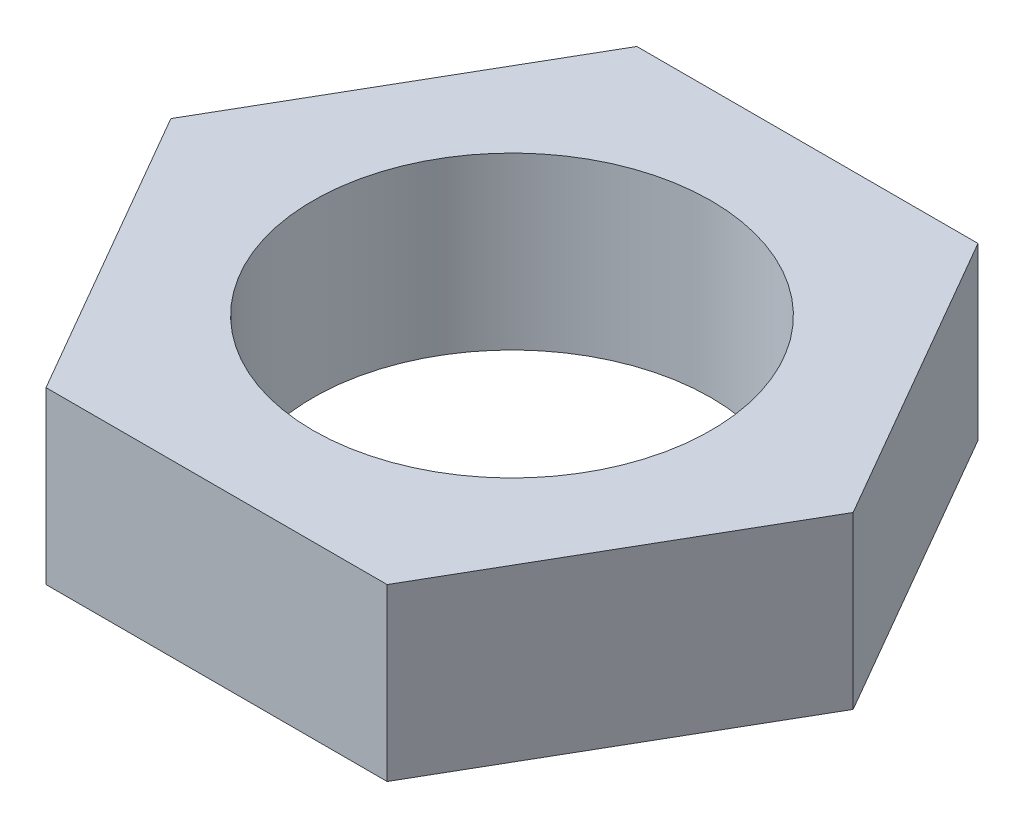
ISO-10303-21;
HEADER;
FILE_DESCRIPTION(('STEP AP214'),'2;1');
FILE_NAME('part.step','',(''),(''),'','','');
FILE_SCHEMA(('AUTOMOTIVE_DESIGN { 1 0 10303 214 1 1 1 1 }'));
ENDSEC;
DATA;
#1=APPLICATION_CONTEXT('core data for automotive mechanical design processes');
#2=APPLICATION_PROTOCOL_DEFINITION('international standard','automotive_design',2000,#1);
#3=PRODUCT_CONTEXT('',#1,'mechanical');
#4=PRODUCT('Part','Part','',(#3));
#5=PRODUCT_RELATED_PRODUCT_CATEGORY('part','',(#4));
#6=PRODUCT_DEFINITION_FORMATION('','',#4);
#7=PRODUCT_DEFINITION_CONTEXT('part definition',#1,'design');
#8=PRODUCT_DEFINITION('design','',#6,#7);
#9=PRODUCT_DEFINITION_SHAPE('','',#8);
#10=(LENGTH_UNIT() NAMED_UNIT(*) SI_UNIT(.MILLI.,.METRE.));
#11=(NAMED_UNIT(*) PLANE_ANGLE_UNIT() SI_UNIT($,.RADIAN.));
#12=(NAMED_UNIT(*) SI_UNIT($,.STERADIAN.) SOLID_ANGLE_UNIT());
#13=UNCERTAINTY_MEASURE_WITH_UNIT(LENGTH_MEASURE(1.E-05),#10,'distance_accuracy_value','');
#14=(GEOMETRIC_REPRESENTATION_CONTEXT(3) GLOBAL_UNCERTAINTY_ASSIGNED_CONTEXT((#13)) GLOBAL_UNIT_ASSIGNED_CONTEXT((#10,
#11,#12)) REPRESENTATION_CONTEXT('',''));
#15=CARTESIAN_POINT('',(0.,0.,0.));
#16=DIRECTION('',(0.,0.,1.));
#17=DIRECTION('',(1.,0.,0.));
#18=AXIS2_PLACEMENT_3D('',#15,#16,#17);
#19=CARTESIAN_POINT('',(3.00000000000005,3.,5.19615242270659));
#20=DIRECTION('',(-0.866025403784441,0.,-0.499999999999995));
#21=DIRECTION('',(-0.499999999999995,0.,0.866025403784442));
#22=AXIS2_PLACEMENT_3D('',#19,#20,#21);
#23=PLANE('',#22);
#24=DIRECTION('',(0.499999999999995,0.,-0.866025403784442));
#25=VECTOR('',#24,1.);
#26=CARTESIAN_POINT('',(3.00000000000005,0.,5.19615242270659));
#27=LINE('',#26,#25);
#28=CARTESIAN_POINT('',(3.00000000000005,0.,5.19615242270659));
#29=VERTEX_POINT('',#28);
#30=CARTESIAN_POINT('',(5.99999999999999,0.,0.));
#31=VERTEX_POINT('',#30);
#32=EDGE_CURVE('E125',#29,#31,#27,.T.);
#33=ORIENTED_EDGE('',*,*,#32,.T.);
#34=DIRECTION('',(0.,-1.,0.));
#35=VECTOR('',#34,1.);
#36=CARTESIAN_POINT('',(5.99999999999999,3.,0.));
#37=LINE('',#36,#35);
#38=CARTESIAN_POINT('',(5.99999999999999,3.,0.));
#39=VERTEX_POINT('',#38);
#40=EDGE_CURVE('E11',#39,#31,#37,.T.);
#41=ORIENTED_EDGE('',*,*,#40,.F.);
#42=DIRECTION('',(0.499999999999995,0.,-0.866025403784442));
#43=VECTOR('',#42,1.);
#44=CARTESIAN_POINT('',(3.00000000000005,3.,5.19615242270659));
#45=LINE('',#44,#43);
#46=CARTESIAN_POINT('',(3.00000000000005,3.,5.19615242270659));
#47=VERTEX_POINT('',#46);
#48=EDGE_CURVE('E136',#47,#39,#45,.T.);
#49=ORIENTED_EDGE('',*,*,#48,.F.);
#50=DIRECTION('',(0.,-1.,0.));
#51=VECTOR('',#50,1.);
#52=CARTESIAN_POINT('',(3.00000000000005,3.,5.19615242270659));
#53=LINE('',#52,#51);
#54=EDGE_CURVE('E121',#47,#29,#53,.T.);
#55=ORIENTED_EDGE('',*,*,#54,.T.);
#56=EDGE_LOOP('',(#33,#41,#49,#55));
#57=FACE_BOUND('',#56,.T.);
#58=ADVANCED_FACE('F41',(#57),#23,.F.);
#59=CARTESIAN_POINT('',(5.99999999999999,3.,0.));
#60=DIRECTION('',(-0.866025403784438,0.,0.500000000000001));
#61=DIRECTION('',(0.500000000000001,0.,0.866025403784438));
#62=AXIS2_PLACEMENT_3D('',#59,#60,#61);
#63=PLANE('',#62);
#64=DIRECTION('',(-0.500000000000001,0.,-0.866025403784438));
#65=VECTOR('',#64,1.);
#66=CARTESIAN_POINT('',(5.99999999999999,0.,0.));
#67=LINE('',#66,#65);
#68=CARTESIAN_POINT('',(2.99999999999998,0.,-5.19615242270663));
#69=VERTEX_POINT('',#68);
#70=EDGE_CURVE('E128',#31,#69,#67,.T.);
#71=ORIENTED_EDGE('',*,*,#70,.T.);
#72=DIRECTION('',(0.,-1.,0.));
#73=VECTOR('',#72,1.);
#74=CARTESIAN_POINT('',(2.99999999999998,3.,-5.19615242270663));
#75=LINE('',#74,#73);
#76=CARTESIAN_POINT('',(2.99999999999998,3.,-5.19615242270663));
#77=VERTEX_POINT('',#76);
#78=EDGE_CURVE('E49',#77,#69,#75,.T.);
#79=ORIENTED_EDGE('',*,*,#78,.F.);
#80=DIRECTION('',(-0.500000000000001,0.,-0.866025403784438));
#81=VECTOR('',#80,1.);
#82=CARTESIAN_POINT('',(5.99999999999999,3.,0.));
#83=LINE('',#82,#81);
#84=EDGE_CURVE('E94',#39,#77,#83,.T.);
#85=ORIENTED_EDGE('',*,*,#84,.F.);
#86=ORIENTED_EDGE('',*,*,#40,.T.);
#87=EDGE_LOOP('',(#71,#79,#85,#86));
#88=FACE_BOUND('',#87,.T.);
#89=ADVANCED_FACE('F161',(#88),#63,.F.);
#90=CARTESIAN_POINT('',(2.99999999999998,3.,-5.19615242270663));
#91=DIRECTION('',(0.,0.,1.));
#92=DIRECTION('',(1.,0.,0.));
#93=AXIS2_PLACEMENT_3D('',#90,#91,#92);
#94=PLANE('',#93);
#95=DIRECTION('',(-1.,0.,0.));
#96=VECTOR('',#95,1.);
#97=CARTESIAN_POINT('',(2.99999999999998,0.,-5.19615242270663));
#98=LINE('',#97,#96);
#99=CARTESIAN_POINT('',(-3.00000000000002,0.,-5.19615242270661));
#100=VERTEX_POINT('',#99);
#101=EDGE_CURVE('E131',#69,#100,#98,.T.);
#102=ORIENTED_EDGE('',*,*,#101,.T.);
#103=DIRECTION('',(0.,-1.,0.));
#104=VECTOR('',#103,1.);
#105=CARTESIAN_POINT('',(-3.00000000000002,3.,-5.19615242270661));
#106=LINE('',#105,#104);
#107=CARTESIAN_POINT('',(-3.00000000000002,3.,-5.19615242270661));
#108=VERTEX_POINT('',#107);
#109=EDGE_CURVE('E116',#108,#100,#106,.T.);
#110=ORIENTED_EDGE('',*,*,#109,.F.);
#111=DIRECTION('',(-1.,0.,0.));
#112=VECTOR('',#111,1.);
#113=CARTESIAN_POINT('',(2.99999999999998,3.,-5.19615242270663));
#114=LINE('',#113,#112);
#115=EDGE_CURVE('E107',#77,#108,#114,.T.);
#116=ORIENTED_EDGE('',*,*,#115,.F.);
#117=ORIENTED_EDGE('',*,*,#78,.T.);
#118=EDGE_LOOP('',(#102,#110,#116,#117));
#119=FACE_BOUND('',#118,.T.);
#120=ADVANCED_FACE('F142',(#119),#94,.F.);
#121=CARTESIAN_POINT('',(-3.00000000000002,3.,-5.19615242270661));
#122=DIRECTION('',(0.866025403784442,0.,0.499999999999995));
#123=DIRECTION('',(0.499999999999995,0.,-0.866025403784442));
#124=AXIS2_PLACEMENT_3D('',#121,#122,#123);
#125=PLANE('',#124);
#126=DIRECTION('',(-0.499999999999995,0.,0.866025403784441));
#127=VECTOR('',#126,1.);
#128=CARTESIAN_POINT('',(-3.00000000000002,0.,-5.19615242270661));
#129=LINE('',#128,#127);
#130=CARTESIAN_POINT('',(-5.99999999999999,0.,0.));
#131=VERTEX_POINT('',#130);
#132=EDGE_CURVE('E115',#100,#131,#129,.T.);
#133=ORIENTED_EDGE('',*,*,#132,.T.);
#134=DIRECTION('',(0.,-1.,0.));
#135=VECTOR('',#134,1.);
#136=CARTESIAN_POINT('',(-5.99999999999999,3.,0.));
#137=LINE('',#136,#135);
#138=CARTESIAN_POINT('',(-5.99999999999999,3.,0.));
#139=VERTEX_POINT('',#138);
#140=EDGE_CURVE('E112',#139,#131,#137,.T.);
#141=ORIENTED_EDGE('',*,*,#140,.F.);
#142=DIRECTION('',(-0.499999999999995,0.,0.866025403784441));
#143=VECTOR('',#142,1.);
#144=CARTESIAN_POINT('',(-3.00000000000002,3.,-5.19615242270661));
#145=LINE('',#144,#143);
#146=EDGE_CURVE('E101',#108,#139,#145,.T.);
#147=ORIENTED_EDGE('',*,*,#146,.F.);
#148=ORIENTED_EDGE('',*,*,#109,.T.);
#149=EDGE_LOOP('',(#133,#141,#147,#148));
#150=FACE_BOUND('',#149,.T.);
#151=ADVANCED_FACE('F113',(#150),#125,.F.);
#152=CARTESIAN_POINT('',(-5.99999999999999,3.,0.));
#153=DIRECTION('',(0.866025403784434,0.,-0.500000000000007));
#154=DIRECTION('',(-0.500000000000007,0.,-0.866025403784435));
#155=AXIS2_PLACEMENT_3D('',#152,#153,#154);
#156=PLANE('',#155);
#157=DIRECTION('',(0.500000000000007,0.,0.866025403784435));
#158=VECTOR('',#157,1.);
#159=CARTESIAN_POINT('',(-5.99999999999999,0.,0.));
#160=LINE('',#159,#158);
#161=CARTESIAN_POINT('',(-2.99999999999995,0.,5.19615242270665));
#162=VERTEX_POINT('',#161);
#163=EDGE_CURVE('E80',#131,#162,#160,.T.);
#164=ORIENTED_EDGE('',*,*,#163,.T.);
#165=DIRECTION('',(0.,-1.,0.));
#166=VECTOR('',#165,1.);
#167=CARTESIAN_POINT('',(-2.99999999999995,3.,5.19615242270665));
#168=LINE('',#167,#166);
#169=CARTESIAN_POINT('',(-2.99999999999995,3.,5.19615242270665));
#170=VERTEX_POINT('',#169);
#171=EDGE_CURVE('E117',#170,#162,#168,.T.);
#172=ORIENTED_EDGE('',*,*,#171,.F.);
#173=DIRECTION('',(0.500000000000007,0.,0.866025403784435));
#174=VECTOR('',#173,1.);
#175=CARTESIAN_POINT('',(-5.99999999999999,3.,0.));
#176=LINE('',#175,#174);
#177=EDGE_CURVE('E105',#139,#170,#176,.T.);
#178=ORIENTED_EDGE('',*,*,#177,.F.);
#179=ORIENTED_EDGE('',*,*,#140,.T.);
#180=EDGE_LOOP('',(#164,#172,#178,#179));
#181=FACE_BOUND('',#180,.T.);
#182=ADVANCED_FACE('F119',(#181),#156,.F.);
#183=CARTESIAN_POINT('',(-2.99999999999995,3.,5.19615242270665));
#184=DIRECTION('',(0.,0.,-1.));
#185=DIRECTION('',(-1.,0.,0.));
#186=AXIS2_PLACEMENT_3D('',#183,#184,#185);
#187=PLANE('',#186);
#188=DIRECTION('',(1.,0.,0.));
#189=VECTOR('',#188,1.);
#190=CARTESIAN_POINT('',(-2.99999999999995,0.,5.19615242270665));
#191=LINE('',#190,#189);
#192=EDGE_CURVE('E86',#162,#29,#191,.T.);
#193=ORIENTED_EDGE('',*,*,#192,.T.);
#194=ORIENTED_EDGE('',*,*,#54,.F.);
#195=DIRECTION('',(1.,0.,0.));
#196=VECTOR('',#195,1.);
#197=CARTESIAN_POINT('',(-2.99999999999995,3.,5.19615242270665));
#198=LINE('',#197,#196);
#199=EDGE_CURVE('E57',#170,#47,#198,.T.);
#200=ORIENTED_EDGE('',*,*,#199,.F.);
#201=ORIENTED_EDGE('',*,*,#171,.T.);
#202=EDGE_LOOP('',(#193,#194,#200,#201));
#203=FACE_BOUND('',#202,.T.);
#204=ADVANCED_FACE('F149',(#203),#187,.F.);
#205=CARTESIAN_POINT('',(0.,3.,0.));
#206=DIRECTION('',(0.,1.,0.));
#207=DIRECTION('',(0.,0.,1.));
#208=AXIS2_PLACEMENT_3D('',#205,#206,#207);
#209=PLANE('',#208);
#210=CARTESIAN_POINT('',(0.,3.,0.));
#211=DIRECTION('',(0.,1.,0.));
#212=DIRECTION('',(0.,0.,1.));
#213=AXIS2_PLACEMENT_3D('',#210,#211,#212);
#214=CIRCLE('',#213,3.5);
#215=CARTESIAN_POINT('',(0.,3.,3.5));
#216=VERTEX_POINT('',#215);
#217=EDGE_CURVE('E217',#216,#216,#214,.T.);
#218=ORIENTED_EDGE('',*,*,#217,.F.);
#219=EDGE_LOOP('',(#218));
#220=FACE_BOUND('',#219,.T.);
#221=ORIENTED_EDGE('',*,*,#48,.T.);
#222=ORIENTED_EDGE('',*,*,#84,.T.);
#223=ORIENTED_EDGE('',*,*,#115,.T.);
#224=ORIENTED_EDGE('',*,*,#146,.T.);
#225=ORIENTED_EDGE('',*,*,#177,.T.);
#226=ORIENTED_EDGE('',*,*,#199,.T.);
#227=EDGE_LOOP('',(#221,#222,#223,#224,#225,#226));
#228=FACE_BOUND('',#227,.T.);
#229=ADVANCED_FACE('F103',(#220,#228),#209,.T.);
#230=CARTESIAN_POINT('',(0.,0.,0.));
#231=DIRECTION('',(0.,1.,0.));
#232=DIRECTION('',(0.,0.,1.));
#233=AXIS2_PLACEMENT_3D('',#230,#231,#232);
#234=PLANE('',#233);
#235=CARTESIAN_POINT('',(0.,0.,0.));
#236=DIRECTION('',(0.,1.,0.));
#237=DIRECTION('',(0.,0.,1.));
#238=AXIS2_PLACEMENT_3D('',#235,#236,#237);
#239=CIRCLE('',#238,3.5);
#240=CARTESIAN_POINT('',(0.,0.,3.5));
#241=VERTEX_POINT('',#240);
#242=EDGE_CURVE('E129',#241,#241,#239,.T.);
#243=ORIENTED_EDGE('',*,*,#242,.T.);
#244=EDGE_LOOP('',(#243));
#245=FACE_BOUND('',#244,.T.);
#246=ORIENTED_EDGE('',*,*,#32,.F.);
#247=ORIENTED_EDGE('',*,*,#192,.F.);
#248=ORIENTED_EDGE('',*,*,#163,.F.);
#249=ORIENTED_EDGE('',*,*,#132,.F.);
#250=ORIENTED_EDGE('',*,*,#101,.F.);
#251=ORIENTED_EDGE('',*,*,#70,.F.);
#252=EDGE_LOOP('',(#246,#247,#248,#249,#250,#251));
#253=FACE_BOUND('',#252,.T.);
#254=ADVANCED_FACE('F145',(#245,#253),#234,.F.);
#255=CARTESIAN_POINT('',(0.,0.,0.));
#256=DIRECTION('',(0.,1.,0.));
#257=DIRECTION('',(0.,0.,1.));
#258=AXIS2_PLACEMENT_3D('',#255,#256,#257);
#259=CYLINDRICAL_SURFACE('',#258,3.5);
#260=ORIENTED_EDGE('',*,*,#242,.F.);
#261=EDGE_LOOP('',(#260));
#262=FACE_BOUND('',#261,.T.);
#263=ORIENTED_EDGE('',*,*,#217,.T.);
#264=EDGE_LOOP('',(#263));
#265=FACE_BOUND('',#264,.T.);
#266=ADVANCED_FACE('F200',(#262,#265),#259,.F.);
#267=CLOSED_SHELL('',(#58,#89,#120,#151,#182,#204,#229,#254,#266));
#268=MANIFOLD_SOLID_BREP('B2',#267);
#269=ADVANCED_BREP_SHAPE_REPRESENTATION('',(#18,#268),#14);
#270=SHAPE_DEFINITION_REPRESENTATION(#9,#269);
ENDSEC;
END-ISO-10303-21;
